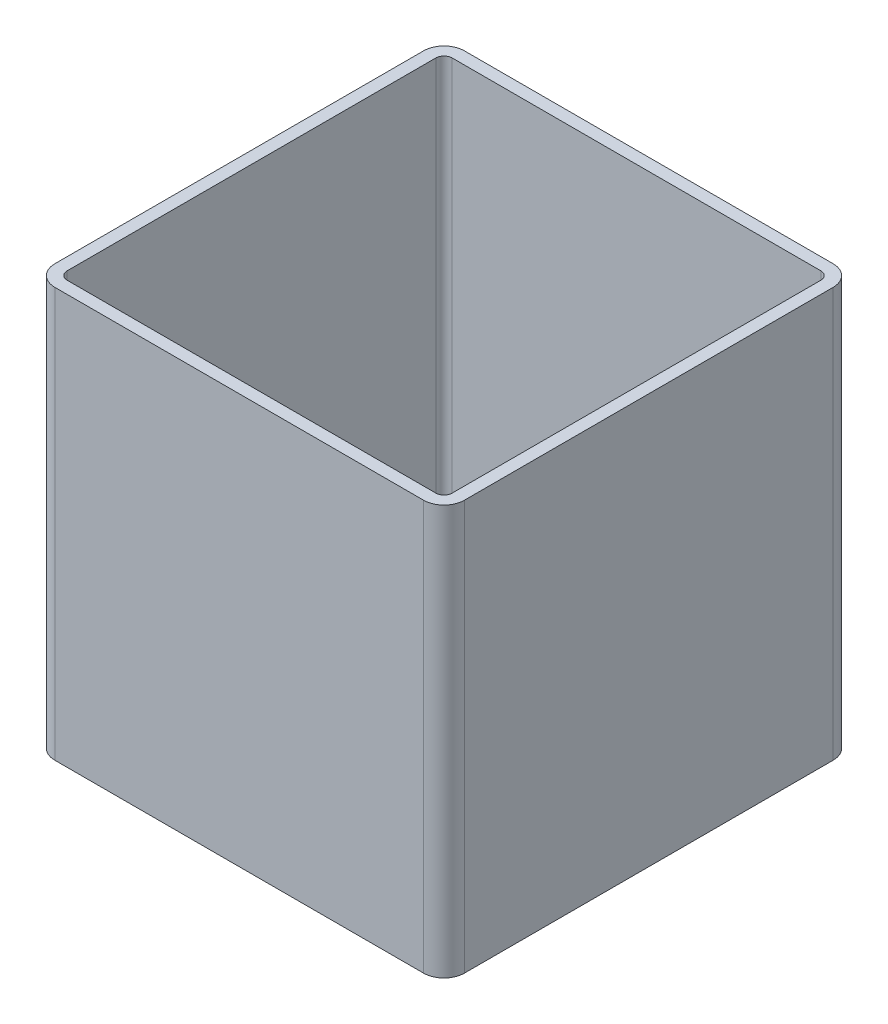
ISO-10303-21;
HEADER;
FILE_DESCRIPTION(('STEP AP214'),'2;1');
FILE_NAME('part.step','',(''),(''),'','','');
FILE_SCHEMA(('AUTOMOTIVE_DESIGN { 1 0 10303 214 1 1 1 1 }'));
ENDSEC;
DATA;
#1=APPLICATION_CONTEXT('core data for automotive mechanical design processes');
#2=APPLICATION_PROTOCOL_DEFINITION('international standard','automotive_design',2000,#1);
#3=PRODUCT_CONTEXT('',#1,'mechanical');
#4=PRODUCT('Part','Part','',(#3));
#5=PRODUCT_RELATED_PRODUCT_CATEGORY('part','',(#4));
#6=PRODUCT_DEFINITION_FORMATION('','',#4);
#7=PRODUCT_DEFINITION_CONTEXT('part definition',#1,'design');
#8=PRODUCT_DEFINITION('design','',#6,#7);
#9=PRODUCT_DEFINITION_SHAPE('','',#8);
#10=(LENGTH_UNIT() NAMED_UNIT(*) SI_UNIT(.MILLI.,.METRE.));
#11=(NAMED_UNIT(*) PLANE_ANGLE_UNIT() SI_UNIT($,.RADIAN.));
#12=(NAMED_UNIT(*) SI_UNIT($,.STERADIAN.) SOLID_ANGLE_UNIT());
#13=UNCERTAINTY_MEASURE_WITH_UNIT(LENGTH_MEASURE(1.E-05),#10,'distance_accuracy_value','');
#14=(GEOMETRIC_REPRESENTATION_CONTEXT(3) GLOBAL_UNCERTAINTY_ASSIGNED_CONTEXT((#13)) GLOBAL_UNIT_ASSIGNED_CONTEXT((#10,
#11,#12)) REPRESENTATION_CONTEXT('',''));
#15=CARTESIAN_POINT('',(0.,0.,0.));
#16=DIRECTION('',(0.,0.,1.));
#17=DIRECTION('',(1.,0.,0.));
#18=AXIS2_PLACEMENT_3D('',#15,#16,#17);
#19=CARTESIAN_POINT('',(-45.,100.,45.));
#20=DIRECTION('',(0.,1.,0.));
#21=DIRECTION('',(0.,0.,1.));
#22=AXIS2_PLACEMENT_3D('',#19,#20,#21);
#23=PLANE('',#22);
#24=CARTESIAN_POINT('',(-45.,100.,45.));
#25=DIRECTION('',(0.,1.,0.));
#26=DIRECTION('',(0.,0.,1.));
#27=AXIS2_PLACEMENT_3D('',#24,#25,#26);
#28=CIRCLE('',#27,5.);
#29=CARTESIAN_POINT('',(-50.,100.,45.));
#30=VERTEX_POINT('',#29);
#31=CARTESIAN_POINT('',(-45.,100.,50.));
#32=VERTEX_POINT('',#31);
#33=EDGE_CURVE('E261',#30,#32,#28,.T.);
#34=ORIENTED_EDGE('',*,*,#33,.T.);
#35=DIRECTION('',(1.,0.,0.));
#36=VECTOR('',#35,1.);
#37=CARTESIAN_POINT('',(-45.,100.,50.));
#38=LINE('',#37,#36);
#39=CARTESIAN_POINT('',(45.,100.,50.));
#40=VERTEX_POINT('',#39);
#41=EDGE_CURVE('E264',#32,#40,#38,.T.);
#42=ORIENTED_EDGE('',*,*,#41,.T.);
#43=CARTESIAN_POINT('',(45.,100.,45.));
#44=DIRECTION('',(0.,1.,0.));
#45=DIRECTION('',(0.,0.,1.));
#46=AXIS2_PLACEMENT_3D('',#43,#44,#45);
#47=CIRCLE('',#46,5.);
#48=CARTESIAN_POINT('',(50.,100.,45.));
#49=VERTEX_POINT('',#48);
#50=EDGE_CURVE('E267',#40,#49,#47,.T.);
#51=ORIENTED_EDGE('',*,*,#50,.T.);
#52=DIRECTION('',(0.,0.,-1.));
#53=VECTOR('',#52,1.);
#54=CARTESIAN_POINT('',(50.,100.,-45.));
#55=LINE('',#54,#53);
#56=CARTESIAN_POINT('',(50.,100.,-45.));
#57=VERTEX_POINT('',#56);
#58=EDGE_CURVE('E269',#49,#57,#55,.T.);
#59=ORIENTED_EDGE('',*,*,#58,.T.);
#60=CARTESIAN_POINT('',(45.,100.,-45.));
#61=DIRECTION('',(0.,1.,0.));
#62=DIRECTION('',(0.,0.,-1.));
#63=AXIS2_PLACEMENT_3D('',#60,#61,#62);
#64=CIRCLE('',#63,5.);
#65=CARTESIAN_POINT('',(45.,100.,-50.));
#66=VERTEX_POINT('',#65);
#67=EDGE_CURVE('E271',#57,#66,#64,.T.);
#68=ORIENTED_EDGE('',*,*,#67,.T.);
#69=DIRECTION('',(-1.,0.,0.));
#70=VECTOR('',#69,1.);
#71=CARTESIAN_POINT('',(-45.,100.,-50.));
#72=LINE('',#71,#70);
#73=CARTESIAN_POINT('',(-45.,100.,-50.));
#74=VERTEX_POINT('',#73);
#75=EDGE_CURVE('E273',#66,#74,#72,.T.);
#76=ORIENTED_EDGE('',*,*,#75,.T.);
#77=CARTESIAN_POINT('',(-45.,100.,-45.));
#78=DIRECTION('',(0.,1.,0.));
#79=DIRECTION('',(0.,0.,1.));
#80=AXIS2_PLACEMENT_3D('',#77,#78,#79);
#81=CIRCLE('',#80,5.);
#82=CARTESIAN_POINT('',(-50.,100.,-45.));
#83=VERTEX_POINT('',#82);
#84=EDGE_CURVE('E275',#74,#83,#81,.T.);
#85=ORIENTED_EDGE('',*,*,#84,.T.);
#86=DIRECTION('',(0.,0.,1.));
#87=VECTOR('',#86,1.);
#88=CARTESIAN_POINT('',(-50.,100.,-45.));
#89=LINE('',#88,#87);
#90=EDGE_CURVE('E277',#83,#30,#89,.T.);
#91=ORIENTED_EDGE('',*,*,#90,.T.);
#92=EDGE_LOOP('',(#34,#42,#51,#59,#68,#76,#85,#91));
#93=FACE_BOUND('',#92,.T.);
#94=DIRECTION('',(1.,0.,0.));
#95=VECTOR('',#94,1.);
#96=CARTESIAN_POINT('',(-45.,100.,47.));
#97=LINE('',#96,#95);
#98=CARTESIAN_POINT('',(-45.,100.,47.));
#99=VERTEX_POINT('',#98);
#100=CARTESIAN_POINT('',(45.,100.,47.));
#101=VERTEX_POINT('',#100);
#102=EDGE_CURVE('E204',#99,#101,#97,.T.);
#103=ORIENTED_EDGE('',*,*,#102,.F.);
#104=CARTESIAN_POINT('',(-45.,100.,45.));
#105=DIRECTION('',(0.,1.,0.));
#106=DIRECTION('',(1.,0.,0.));
#107=AXIS2_PLACEMENT_3D('',#104,#105,#106);
#108=CIRCLE('',#107,2.);
#109=CARTESIAN_POINT('',(-47.,100.,45.));
#110=VERTEX_POINT('',#109);
#111=EDGE_CURVE('E196',#110,#99,#108,.T.);
#112=ORIENTED_EDGE('',*,*,#111,.F.);
#113=DIRECTION('',(0.,0.,1.));
#114=VECTOR('',#113,1.);
#115=CARTESIAN_POINT('',(-47.,100.,-45.));
#116=LINE('',#115,#114);
#117=CARTESIAN_POINT('',(-47.,100.,-45.));
#118=VERTEX_POINT('',#117);
#119=EDGE_CURVE('E229',#118,#110,#116,.T.);
#120=ORIENTED_EDGE('',*,*,#119,.F.);
#121=CARTESIAN_POINT('',(-45.,100.,-45.));
#122=DIRECTION('',(0.,1.,0.));
#123=DIRECTION('',(1.,0.,0.));
#124=AXIS2_PLACEMENT_3D('',#121,#122,#123);
#125=CIRCLE('',#124,2.);
#126=CARTESIAN_POINT('',(-45.,100.,-47.));
#127=VERTEX_POINT('',#126);
#128=EDGE_CURVE('E227',#127,#118,#125,.T.);
#129=ORIENTED_EDGE('',*,*,#128,.F.);
#130=DIRECTION('',(-1.,0.,0.));
#131=VECTOR('',#130,1.);
#132=CARTESIAN_POINT('',(-45.,100.,-47.));
#133=LINE('',#132,#131);
#134=CARTESIAN_POINT('',(45.,100.,-47.));
#135=VERTEX_POINT('',#134);
#136=EDGE_CURVE('E225',#135,#127,#133,.T.);
#137=ORIENTED_EDGE('',*,*,#136,.F.);
#138=CARTESIAN_POINT('',(45.,100.,-45.));
#139=DIRECTION('',(0.,1.,0.));
#140=DIRECTION('',(1.,0.,0.));
#141=AXIS2_PLACEMENT_3D('',#138,#139,#140);
#142=CIRCLE('',#141,2.);
#143=CARTESIAN_POINT('',(47.,100.,-45.));
#144=VERTEX_POINT('',#143);
#145=EDGE_CURVE('E223',#144,#135,#142,.T.);
#146=ORIENTED_EDGE('',*,*,#145,.F.);
#147=DIRECTION('',(0.,0.,-1.));
#148=VECTOR('',#147,1.);
#149=CARTESIAN_POINT('',(47.,100.,-45.));
#150=LINE('',#149,#148);
#151=CARTESIAN_POINT('',(47.,100.,45.));
#152=VERTEX_POINT('',#151);
#153=EDGE_CURVE('E219',#152,#144,#150,.T.);
#154=ORIENTED_EDGE('',*,*,#153,.F.);
#155=CARTESIAN_POINT('',(45.,100.,45.));
#156=DIRECTION('',(0.,1.,0.));
#157=DIRECTION('',(1.,0.,0.));
#158=AXIS2_PLACEMENT_3D('',#155,#156,#157);
#159=CIRCLE('',#158,2.);
#160=EDGE_CURVE('E217',#101,#152,#159,.T.);
#161=ORIENTED_EDGE('',*,*,#160,.F.);
#162=EDGE_LOOP('',(#103,#112,#120,#129,#137,#146,#154,#161));
#163=FACE_BOUND('',#162,.T.);
#164=ADVANCED_FACE('F83',(#93,#163),#23,.T.);
#165=CARTESIAN_POINT('',(-45.,0.,45.));
#166=DIRECTION('',(0.,1.,0.));
#167=DIRECTION('',(0.,0.,1.));
#168=AXIS2_PLACEMENT_3D('',#165,#166,#167);
#169=PLANE('',#168);
#170=CARTESIAN_POINT('',(-45.,0.,45.));
#171=DIRECTION('',(0.,1.,0.));
#172=DIRECTION('',(0.,0.,1.));
#173=AXIS2_PLACEMENT_3D('',#170,#171,#172);
#174=CIRCLE('',#173,5.);
#175=CARTESIAN_POINT('',(-50.,0.,45.));
#176=VERTEX_POINT('',#175);
#177=CARTESIAN_POINT('',(-45.,0.,50.));
#178=VERTEX_POINT('',#177);
#179=EDGE_CURVE('E212',#176,#178,#174,.T.);
#180=ORIENTED_EDGE('',*,*,#179,.F.);
#181=DIRECTION('',(0.,0.,1.));
#182=VECTOR('',#181,1.);
#183=CARTESIAN_POINT('',(-50.,0.,-45.));
#184=LINE('',#183,#182);
#185=CARTESIAN_POINT('',(-50.,0.,-45.));
#186=VERTEX_POINT('',#185);
#187=EDGE_CURVE('E265',#186,#176,#184,.T.);
#188=ORIENTED_EDGE('',*,*,#187,.F.);
#189=CARTESIAN_POINT('',(-45.,0.,-45.));
#190=DIRECTION('',(0.,1.,0.));
#191=DIRECTION('',(0.,0.,1.));
#192=AXIS2_PLACEMENT_3D('',#189,#190,#191);
#193=CIRCLE('',#192,5.);
#194=CARTESIAN_POINT('',(-45.,0.,-50.));
#195=VERTEX_POINT('',#194);
#196=EDGE_CURVE('E292',#195,#186,#193,.T.);
#197=ORIENTED_EDGE('',*,*,#196,.F.);
#198=DIRECTION('',(-1.,0.,0.));
#199=VECTOR('',#198,1.);
#200=CARTESIAN_POINT('',(-45.,0.,-50.));
#201=LINE('',#200,#199);
#202=CARTESIAN_POINT('',(45.,0.,-50.));
#203=VERTEX_POINT('',#202);
#204=EDGE_CURVE('E290',#203,#195,#201,.T.);
#205=ORIENTED_EDGE('',*,*,#204,.F.);
#206=CARTESIAN_POINT('',(45.,0.,-45.));
#207=DIRECTION('',(0.,1.,0.));
#208=DIRECTION('',(0.,0.,-1.));
#209=AXIS2_PLACEMENT_3D('',#206,#207,#208);
#210=CIRCLE('',#209,5.);
#211=CARTESIAN_POINT('',(50.,0.,-45.));
#212=VERTEX_POINT('',#211);
#213=EDGE_CURVE('E288',#212,#203,#210,.T.);
#214=ORIENTED_EDGE('',*,*,#213,.F.);
#215=DIRECTION('',(0.,0.,-1.));
#216=VECTOR('',#215,1.);
#217=CARTESIAN_POINT('',(50.,0.,-45.));
#218=LINE('',#217,#216);
#219=CARTESIAN_POINT('',(50.,0.,45.));
#220=VERTEX_POINT('',#219);
#221=EDGE_CURVE('E286',#220,#212,#218,.T.);
#222=ORIENTED_EDGE('',*,*,#221,.F.);
#223=CARTESIAN_POINT('',(45.,0.,45.));
#224=DIRECTION('',(0.,1.,0.));
#225=DIRECTION('',(0.,0.,1.));
#226=AXIS2_PLACEMENT_3D('',#223,#224,#225);
#227=CIRCLE('',#226,5.);
#228=CARTESIAN_POINT('',(45.,0.,50.));
#229=VERTEX_POINT('',#228);
#230=EDGE_CURVE('E284',#229,#220,#227,.T.);
#231=ORIENTED_EDGE('',*,*,#230,.F.);
#232=DIRECTION('',(1.,0.,0.));
#233=VECTOR('',#232,1.);
#234=CARTESIAN_POINT('',(-45.,0.,50.));
#235=LINE('',#234,#233);
#236=EDGE_CURVE('E282',#178,#229,#235,.T.);
#237=ORIENTED_EDGE('',*,*,#236,.F.);
#238=EDGE_LOOP('',(#180,#188,#197,#205,#214,#222,#231,#237));
#239=FACE_BOUND('',#238,.T.);
#240=CARTESIAN_POINT('',(-45.,0.,45.));
#241=DIRECTION('',(0.,1.,0.));
#242=DIRECTION('',(1.,0.,0.));
#243=AXIS2_PLACEMENT_3D('',#240,#241,#242);
#244=CIRCLE('',#243,2.);
#245=CARTESIAN_POINT('',(-47.,0.,45.));
#246=VERTEX_POINT('',#245);
#247=CARTESIAN_POINT('',(-45.,0.,47.));
#248=VERTEX_POINT('',#247);
#249=EDGE_CURVE('E106',#246,#248,#244,.T.);
#250=ORIENTED_EDGE('',*,*,#249,.T.);
#251=DIRECTION('',(1.,0.,0.));
#252=VECTOR('',#251,1.);
#253=CARTESIAN_POINT('',(-45.,0.,47.));
#254=LINE('',#253,#252);
#255=CARTESIAN_POINT('',(45.,0.,47.));
#256=VERTEX_POINT('',#255);
#257=EDGE_CURVE('E211',#248,#256,#254,.T.);
#258=ORIENTED_EDGE('',*,*,#257,.T.);
#259=CARTESIAN_POINT('',(45.,0.,45.));
#260=DIRECTION('',(0.,1.,0.));
#261=DIRECTION('',(1.,0.,0.));
#262=AXIS2_PLACEMENT_3D('',#259,#260,#261);
#263=CIRCLE('',#262,2.);
#264=CARTESIAN_POINT('',(47.,0.,45.));
#265=VERTEX_POINT('',#264);
#266=EDGE_CURVE('E233',#256,#265,#263,.T.);
#267=ORIENTED_EDGE('',*,*,#266,.T.);
#268=DIRECTION('',(0.,0.,-1.));
#269=VECTOR('',#268,1.);
#270=CARTESIAN_POINT('',(47.,0.,-45.));
#271=LINE('',#270,#269);
#272=CARTESIAN_POINT('',(47.,0.,-45.));
#273=VERTEX_POINT('',#272);
#274=EDGE_CURVE('E236',#265,#273,#271,.T.);
#275=ORIENTED_EDGE('',*,*,#274,.T.);
#276=CARTESIAN_POINT('',(45.,0.,-45.));
#277=DIRECTION('',(0.,1.,0.));
#278=DIRECTION('',(1.,0.,0.));
#279=AXIS2_PLACEMENT_3D('',#276,#277,#278);
#280=CIRCLE('',#279,2.);
#281=CARTESIAN_POINT('',(45.,0.,-47.));
#282=VERTEX_POINT('',#281);
#283=EDGE_CURVE('E239',#273,#282,#280,.T.);
#284=ORIENTED_EDGE('',*,*,#283,.T.);
#285=DIRECTION('',(-1.,0.,0.));
#286=VECTOR('',#285,1.);
#287=CARTESIAN_POINT('',(-45.,0.,-47.));
#288=LINE('',#287,#286);
#289=CARTESIAN_POINT('',(-45.,0.,-47.));
#290=VERTEX_POINT('',#289);
#291=EDGE_CURVE('E242',#282,#290,#288,.T.);
#292=ORIENTED_EDGE('',*,*,#291,.T.);
#293=CARTESIAN_POINT('',(-45.,0.,-45.));
#294=DIRECTION('',(0.,1.,0.));
#295=DIRECTION('',(1.,0.,0.));
#296=AXIS2_PLACEMENT_3D('',#293,#294,#295);
#297=CIRCLE('',#296,2.);
#298=CARTESIAN_POINT('',(-47.,0.,-45.));
#299=VERTEX_POINT('',#298);
#300=EDGE_CURVE('E245',#290,#299,#297,.T.);
#301=ORIENTED_EDGE('',*,*,#300,.T.);
#302=DIRECTION('',(0.,0.,1.));
#303=VECTOR('',#302,1.);
#304=CARTESIAN_POINT('',(-47.,0.,-45.));
#305=LINE('',#304,#303);
#306=EDGE_CURVE('E205',#299,#246,#305,.T.);
#307=ORIENTED_EDGE('',*,*,#306,.T.);
#308=EDGE_LOOP('',(#250,#258,#267,#275,#284,#292,#301,#307));
#309=FACE_BOUND('',#308,.T.);
#310=ADVANCED_FACE('F322',(#239,#309),#169,.F.);
#311=CARTESIAN_POINT('',(-45.,100.,45.));
#312=DIRECTION('',(0.,-1.,0.));
#313=DIRECTION('',(0.,0.,-1.));
#314=AXIS2_PLACEMENT_3D('',#311,#312,#313);
#315=CYLINDRICAL_SURFACE('',#314,5.);
#316=ORIENTED_EDGE('',*,*,#179,.T.);
#317=DIRECTION('',(0.,-1.,0.));
#318=VECTOR('',#317,1.);
#319=CARTESIAN_POINT('',(-45.,100.,50.));
#320=LINE('',#319,#318);
#321=EDGE_CURVE('E12',#32,#178,#320,.T.);
#322=ORIENTED_EDGE('',*,*,#321,.F.);
#323=ORIENTED_EDGE('',*,*,#33,.F.);
#324=DIRECTION('',(0.,-1.,0.));
#325=VECTOR('',#324,1.);
#326=CARTESIAN_POINT('',(-50.,100.,45.));
#327=LINE('',#326,#325);
#328=EDGE_CURVE('E279',#30,#176,#327,.T.);
#329=ORIENTED_EDGE('',*,*,#328,.T.);
#330=EDGE_LOOP('',(#316,#322,#323,#329));
#331=FACE_BOUND('',#330,.T.);
#332=ADVANCED_FACE('F85',(#331),#315,.T.);
#333=CARTESIAN_POINT('',(-45.,100.,50.));
#334=DIRECTION('',(0.,0.,-1.));
#335=DIRECTION('',(-1.,0.,0.));
#336=AXIS2_PLACEMENT_3D('',#333,#334,#335);
#337=PLANE('',#336);
#338=ORIENTED_EDGE('',*,*,#236,.T.);
#339=DIRECTION('',(0.,-1.,0.));
#340=VECTOR('',#339,1.);
#341=CARTESIAN_POINT('',(45.,100.,50.));
#342=LINE('',#341,#340);
#343=EDGE_CURVE('E91',#40,#229,#342,.T.);
#344=ORIENTED_EDGE('',*,*,#343,.F.);
#345=ORIENTED_EDGE('',*,*,#41,.F.);
#346=ORIENTED_EDGE('',*,*,#321,.T.);
#347=EDGE_LOOP('',(#338,#344,#345,#346));
#348=FACE_BOUND('',#347,.T.);
#349=ADVANCED_FACE('F339',(#348),#337,.F.);
#350=CARTESIAN_POINT('',(45.,100.,45.));
#351=DIRECTION('',(0.,-1.,0.));
#352=DIRECTION('',(0.,0.,-1.));
#353=AXIS2_PLACEMENT_3D('',#350,#351,#352);
#354=CYLINDRICAL_SURFACE('',#353,5.);
#355=ORIENTED_EDGE('',*,*,#230,.T.);
#356=DIRECTION('',(0.,-1.,0.));
#357=VECTOR('',#356,1.);
#358=CARTESIAN_POINT('',(50.,100.,45.));
#359=LINE('',#358,#357);
#360=EDGE_CURVE('E309',#49,#220,#359,.T.);
#361=ORIENTED_EDGE('',*,*,#360,.F.);
#362=ORIENTED_EDGE('',*,*,#50,.F.);
#363=ORIENTED_EDGE('',*,*,#343,.T.);
#364=EDGE_LOOP('',(#355,#361,#362,#363));
#365=FACE_BOUND('',#364,.T.);
#366=ADVANCED_FACE('F316',(#365),#354,.T.);
#367=CARTESIAN_POINT('',(50.,100.,-45.));
#368=DIRECTION('',(-1.,0.,0.));
#369=DIRECTION('',(0.,0.,1.));
#370=AXIS2_PLACEMENT_3D('',#367,#368,#369);
#371=PLANE('',#370);
#372=ORIENTED_EDGE('',*,*,#221,.T.);
#373=DIRECTION('',(0.,-1.,0.));
#374=VECTOR('',#373,1.);
#375=CARTESIAN_POINT('',(50.,100.,-45.));
#376=LINE('',#375,#374);
#377=EDGE_CURVE('E306',#57,#212,#376,.T.);
#378=ORIENTED_EDGE('',*,*,#377,.F.);
#379=ORIENTED_EDGE('',*,*,#58,.F.);
#380=ORIENTED_EDGE('',*,*,#360,.T.);
#381=EDGE_LOOP('',(#372,#378,#379,#380));
#382=FACE_BOUND('',#381,.T.);
#383=ADVANCED_FACE('F328',(#382),#371,.F.);
#384=CARTESIAN_POINT('',(45.,100.,-45.));
#385=DIRECTION('',(0.,-1.,0.));
#386=DIRECTION('',(0.,0.,-1.));
#387=AXIS2_PLACEMENT_3D('',#384,#385,#386);
#388=CYLINDRICAL_SURFACE('',#387,5.);
#389=ORIENTED_EDGE('',*,*,#213,.T.);
#390=DIRECTION('',(0.,-1.,0.));
#391=VECTOR('',#390,1.);
#392=CARTESIAN_POINT('',(45.,100.,-50.));
#393=LINE('',#392,#391);
#394=EDGE_CURVE('E303',#66,#203,#393,.T.);
#395=ORIENTED_EDGE('',*,*,#394,.F.);
#396=ORIENTED_EDGE('',*,*,#67,.F.);
#397=ORIENTED_EDGE('',*,*,#377,.T.);
#398=EDGE_LOOP('',(#389,#395,#396,#397));
#399=FACE_BOUND('',#398,.T.);
#400=ADVANCED_FACE('F332',(#399),#388,.T.);
#401=CARTESIAN_POINT('',(-45.,100.,-50.));
#402=DIRECTION('',(0.,0.,1.));
#403=DIRECTION('',(1.,0.,0.));
#404=AXIS2_PLACEMENT_3D('',#401,#402,#403);
#405=PLANE('',#404);
#406=ORIENTED_EDGE('',*,*,#204,.T.);
#407=DIRECTION('',(0.,-1.,0.));
#408=VECTOR('',#407,1.);
#409=CARTESIAN_POINT('',(-45.,100.,-50.));
#410=LINE('',#409,#408);
#411=EDGE_CURVE('E300',#74,#195,#410,.T.);
#412=ORIENTED_EDGE('',*,*,#411,.F.);
#413=ORIENTED_EDGE('',*,*,#75,.F.);
#414=ORIENTED_EDGE('',*,*,#394,.T.);
#415=EDGE_LOOP('',(#406,#412,#413,#414));
#416=FACE_BOUND('',#415,.T.);
#417=ADVANCED_FACE('F352',(#416),#405,.F.);
#418=CARTESIAN_POINT('',(-45.,100.,-45.));
#419=DIRECTION('',(0.,-1.,0.));
#420=DIRECTION('',(0.,0.,-1.));
#421=AXIS2_PLACEMENT_3D('',#418,#419,#420);
#422=CYLINDRICAL_SURFACE('',#421,5.);
#423=ORIENTED_EDGE('',*,*,#196,.T.);
#424=DIRECTION('',(0.,-1.,0.));
#425=VECTOR('',#424,1.);
#426=CARTESIAN_POINT('',(-50.,100.,-45.));
#427=LINE('',#426,#425);
#428=EDGE_CURVE('E297',#83,#186,#427,.T.);
#429=ORIENTED_EDGE('',*,*,#428,.F.);
#430=ORIENTED_EDGE('',*,*,#84,.F.);
#431=ORIENTED_EDGE('',*,*,#411,.T.);
#432=EDGE_LOOP('',(#423,#429,#430,#431));
#433=FACE_BOUND('',#432,.T.);
#434=ADVANCED_FACE('F350',(#433),#422,.T.);
#435=CARTESIAN_POINT('',(-50.,100.,-45.));
#436=DIRECTION('',(1.,0.,0.));
#437=DIRECTION('',(0.,0.,-1.));
#438=AXIS2_PLACEMENT_3D('',#435,#436,#437);
#439=PLANE('',#438);
#440=ORIENTED_EDGE('',*,*,#187,.T.);
#441=ORIENTED_EDGE('',*,*,#328,.F.);
#442=ORIENTED_EDGE('',*,*,#90,.F.);
#443=ORIENTED_EDGE('',*,*,#428,.T.);
#444=EDGE_LOOP('',(#440,#441,#442,#443));
#445=FACE_BOUND('',#444,.T.);
#446=ADVANCED_FACE('F345',(#445),#439,.F.);
#447=CARTESIAN_POINT('',(-45.,100.,45.));
#448=DIRECTION('',(0.,-1.,0.));
#449=DIRECTION('',(0.,0.,-1.));
#450=AXIS2_PLACEMENT_3D('',#447,#448,#449);
#451=CYLINDRICAL_SURFACE('',#450,2.);
#452=ORIENTED_EDGE('',*,*,#249,.F.);
#453=DIRECTION('',(0.,-1.,0.));
#454=VECTOR('',#453,1.);
#455=CARTESIAN_POINT('',(-47.,100.,45.));
#456=LINE('',#455,#454);
#457=EDGE_CURVE('E200',#110,#246,#456,.T.);
#458=ORIENTED_EDGE('',*,*,#457,.F.);
#459=ORIENTED_EDGE('',*,*,#111,.T.);
#460=DIRECTION('',(0.,-1.,0.));
#461=VECTOR('',#460,1.);
#462=CARTESIAN_POINT('',(-45.,100.,47.));
#463=LINE('',#462,#461);
#464=EDGE_CURVE('E199',#99,#248,#463,.T.);
#465=ORIENTED_EDGE('',*,*,#464,.T.);
#466=EDGE_LOOP('',(#452,#458,#459,#465));
#467=FACE_BOUND('',#466,.T.);
#468=ADVANCED_FACE('F198',(#467),#451,.F.);
#469=CARTESIAN_POINT('',(-45.,100.,47.));
#470=DIRECTION('',(0.,0.,-1.));
#471=DIRECTION('',(-1.,0.,0.));
#472=AXIS2_PLACEMENT_3D('',#469,#470,#471);
#473=PLANE('',#472);
#474=ORIENTED_EDGE('',*,*,#257,.F.);
#475=ORIENTED_EDGE('',*,*,#464,.F.);
#476=ORIENTED_EDGE('',*,*,#102,.T.);
#477=DIRECTION('',(0.,-1.,0.));
#478=VECTOR('',#477,1.);
#479=CARTESIAN_POINT('',(45.,100.,47.));
#480=LINE('',#479,#478);
#481=EDGE_CURVE('E213',#101,#256,#480,.T.);
#482=ORIENTED_EDGE('',*,*,#481,.T.);
#483=EDGE_LOOP('',(#474,#475,#476,#482));
#484=FACE_BOUND('',#483,.T.);
#485=ADVANCED_FACE('F208',(#484),#473,.T.);
#486=CARTESIAN_POINT('',(45.,100.,45.));
#487=DIRECTION('',(0.,-1.,0.));
#488=DIRECTION('',(0.,0.,-1.));
#489=AXIS2_PLACEMENT_3D('',#486,#487,#488);
#490=CYLINDRICAL_SURFACE('',#489,2.);
#491=ORIENTED_EDGE('',*,*,#266,.F.);
#492=ORIENTED_EDGE('',*,*,#481,.F.);
#493=ORIENTED_EDGE('',*,*,#160,.T.);
#494=DIRECTION('',(0.,-1.,0.));
#495=VECTOR('',#494,1.);
#496=CARTESIAN_POINT('',(47.,100.,45.));
#497=LINE('',#496,#495);
#498=EDGE_CURVE('E258',#152,#265,#497,.T.);
#499=ORIENTED_EDGE('',*,*,#498,.T.);
#500=EDGE_LOOP('',(#491,#492,#493,#499));
#501=FACE_BOUND('',#500,.T.);
#502=ADVANCED_FACE('F377',(#501),#490,.F.);
#503=CARTESIAN_POINT('',(47.,100.,-45.));
#504=DIRECTION('',(-1.,0.,0.));
#505=DIRECTION('',(0.,0.,1.));
#506=AXIS2_PLACEMENT_3D('',#503,#504,#505);
#507=PLANE('',#506);
#508=ORIENTED_EDGE('',*,*,#274,.F.);
#509=ORIENTED_EDGE('',*,*,#498,.F.);
#510=ORIENTED_EDGE('',*,*,#153,.T.);
#511=DIRECTION('',(0.,-1.,0.));
#512=VECTOR('',#511,1.);
#513=CARTESIAN_POINT('',(47.,100.,-45.));
#514=LINE('',#513,#512);
#515=EDGE_CURVE('E256',#144,#273,#514,.T.);
#516=ORIENTED_EDGE('',*,*,#515,.T.);
#517=EDGE_LOOP('',(#508,#509,#510,#516));
#518=FACE_BOUND('',#517,.T.);
#519=ADVANCED_FACE('F381',(#518),#507,.T.);
#520=CARTESIAN_POINT('',(45.,100.,-45.));
#521=DIRECTION('',(0.,-1.,0.));
#522=DIRECTION('',(0.,0.,-1.));
#523=AXIS2_PLACEMENT_3D('',#520,#521,#522);
#524=CYLINDRICAL_SURFACE('',#523,2.);
#525=ORIENTED_EDGE('',*,*,#283,.F.);
#526=ORIENTED_EDGE('',*,*,#515,.F.);
#527=ORIENTED_EDGE('',*,*,#145,.T.);
#528=DIRECTION('',(0.,-1.,0.));
#529=VECTOR('',#528,1.);
#530=CARTESIAN_POINT('',(45.,100.,-47.));
#531=LINE('',#530,#529);
#532=EDGE_CURVE('E254',#135,#282,#531,.T.);
#533=ORIENTED_EDGE('',*,*,#532,.T.);
#534=EDGE_LOOP('',(#525,#526,#527,#533));
#535=FACE_BOUND('',#534,.T.);
#536=ADVANCED_FACE('F387',(#535),#524,.F.);
#537=CARTESIAN_POINT('',(-45.,100.,-47.));
#538=DIRECTION('',(0.,0.,1.));
#539=DIRECTION('',(1.,0.,0.));
#540=AXIS2_PLACEMENT_3D('',#537,#538,#539);
#541=PLANE('',#540);
#542=ORIENTED_EDGE('',*,*,#291,.F.);
#543=ORIENTED_EDGE('',*,*,#532,.F.);
#544=ORIENTED_EDGE('',*,*,#136,.T.);
#545=DIRECTION('',(0.,-1.,0.));
#546=VECTOR('',#545,1.);
#547=CARTESIAN_POINT('',(-45.,100.,-47.));
#548=LINE('',#547,#546);
#549=EDGE_CURVE('E252',#127,#290,#548,.T.);
#550=ORIENTED_EDGE('',*,*,#549,.T.);
#551=EDGE_LOOP('',(#542,#543,#544,#550));
#552=FACE_BOUND('',#551,.T.);
#553=ADVANCED_FACE('F391',(#552),#541,.T.);
#554=CARTESIAN_POINT('',(-45.,100.,-45.));
#555=DIRECTION('',(0.,-1.,0.));
#556=DIRECTION('',(0.,0.,-1.));
#557=AXIS2_PLACEMENT_3D('',#554,#555,#556);
#558=CYLINDRICAL_SURFACE('',#557,2.);
#559=ORIENTED_EDGE('',*,*,#300,.F.);
#560=ORIENTED_EDGE('',*,*,#549,.F.);
#561=ORIENTED_EDGE('',*,*,#128,.T.);
#562=DIRECTION('',(0.,-1.,0.));
#563=VECTOR('',#562,1.);
#564=CARTESIAN_POINT('',(-47.,100.,-45.));
#565=LINE('',#564,#563);
#566=EDGE_CURVE('E98',#118,#299,#565,.T.);
#567=ORIENTED_EDGE('',*,*,#566,.T.);
#568=EDGE_LOOP('',(#559,#560,#561,#567));
#569=FACE_BOUND('',#568,.T.);
#570=ADVANCED_FACE('F395',(#569),#558,.F.);
#571=CARTESIAN_POINT('',(-47.,100.,-45.));
#572=DIRECTION('',(1.,0.,0.));
#573=DIRECTION('',(0.,0.,-1.));
#574=AXIS2_PLACEMENT_3D('',#571,#572,#573);
#575=PLANE('',#574);
#576=ORIENTED_EDGE('',*,*,#306,.F.);
#577=ORIENTED_EDGE('',*,*,#566,.F.);
#578=ORIENTED_EDGE('',*,*,#119,.T.);
#579=ORIENTED_EDGE('',*,*,#457,.T.);
#580=EDGE_LOOP('',(#576,#577,#578,#579));
#581=FACE_BOUND('',#580,.T.);
#582=ADVANCED_FACE('F399',(#581),#575,.T.);
#583=CLOSED_SHELL('',(#164,#310,#332,#349,#366,#383,#400,#417,#434,#446,#468,#485,#502,#519,
#536,#553,#570,#582));
#584=MANIFOLD_SOLID_BREP('B2',#583);
#585=ADVANCED_BREP_SHAPE_REPRESENTATION('',(#18,#584),#14);
#586=SHAPE_DEFINITION_REPRESENTATION(#9,#585);
ENDSEC;
END-ISO-10303-21;
